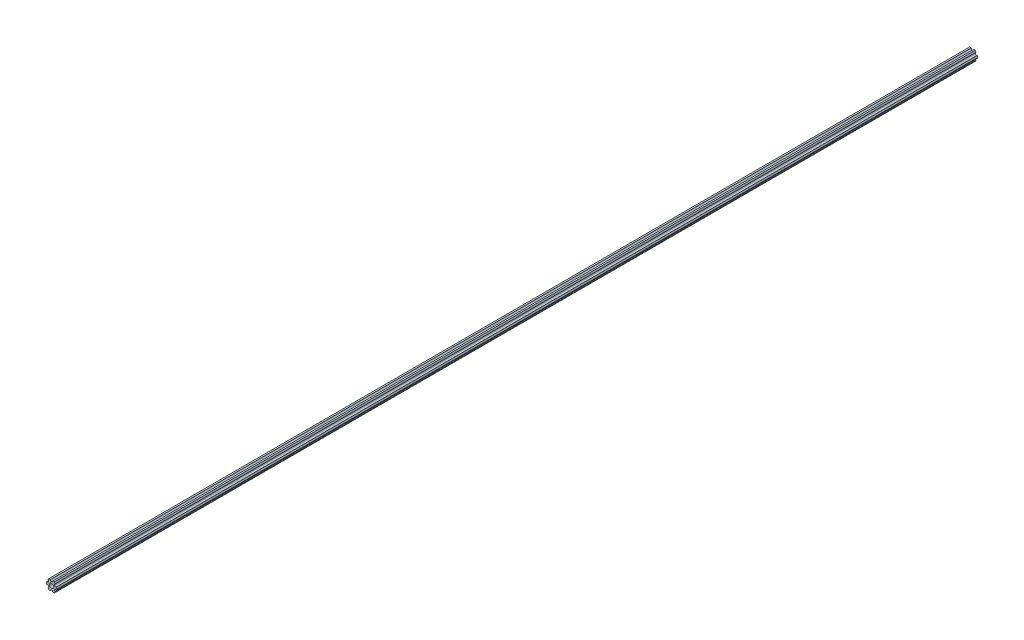
ISO-10303-21;
HEADER;
FILE_DESCRIPTION(('STEP AP214'),'2;1');
FILE_NAME('part.step','',(''),(''),'','','');
FILE_SCHEMA(('AUTOMOTIVE_DESIGN { 1 0 10303 214 1 1 1 1 }'));
ENDSEC;
DATA;
#1=APPLICATION_CONTEXT('core data for automotive mechanical design processes');
#2=APPLICATION_PROTOCOL_DEFINITION('international standard','automotive_design',2000,#1);
#3=PRODUCT_CONTEXT('',#1,'mechanical');
#4=PRODUCT('Part','Part','',(#3));
#5=PRODUCT_RELATED_PRODUCT_CATEGORY('part','',(#4));
#6=PRODUCT_DEFINITION_FORMATION('','',#4);
#7=PRODUCT_DEFINITION_CONTEXT('part definition',#1,'design');
#8=PRODUCT_DEFINITION('design','',#6,#7);
#9=PRODUCT_DEFINITION_SHAPE('','',#8);
#10=(LENGTH_UNIT() NAMED_UNIT(*) SI_UNIT(.MILLI.,.METRE.));
#11=(NAMED_UNIT(*) PLANE_ANGLE_UNIT() SI_UNIT($,.RADIAN.));
#12=(NAMED_UNIT(*) SI_UNIT($,.STERADIAN.) SOLID_ANGLE_UNIT());
#13=UNCERTAINTY_MEASURE_WITH_UNIT(LENGTH_MEASURE(1.E-05),#10,'distance_accuracy_value','');
#14=(GEOMETRIC_REPRESENTATION_CONTEXT(3) GLOBAL_UNCERTAINTY_ASSIGNED_CONTEXT((#13)) GLOBAL_UNIT_ASSIGNED_CONTEXT((#10,
#11,#12)) REPRESENTATION_CONTEXT('',''));
#15=CARTESIAN_POINT('',(0.,0.,0.));
#16=DIRECTION('',(0.,0.,1.));
#17=DIRECTION('',(1.,0.,0.));
#18=AXIS2_PLACEMENT_3D('',#15,#16,#17);
#19=CARTESIAN_POINT('',(6.2949162936079,-1.79688515007796,1212.088));
#20=DIRECTION('',(-0.866025403784439,0.499999999999999,0.));
#21=DIRECTION('',(-0.499999999999999,-0.866025403784439,0.));
#22=AXIS2_PLACEMENT_3D('',#19,#20,#21);
#23=PLANE('',#22);
#24=DIRECTION('',(0.,0.,1.));
#25=VECTOR('',#24,1.);
#26=CARTESIAN_POINT('',(7.33234841870824,0.,1212.088));
#27=LINE('',#26,#25);
#28=CARTESIAN_POINT('',(7.33234841870824,0.,0.));
#29=VERTEX_POINT('',#28);
#30=CARTESIAN_POINT('',(7.33234841870824,0.,1212.088));
#31=VERTEX_POINT('',#30);
#32=EDGE_CURVE('E299',#29,#31,#27,.T.);
#33=ORIENTED_EDGE('',*,*,#32,.T.);
#34=DIRECTION('',(0.499999999999999,0.866025403784439,0.));
#35=VECTOR('',#34,1.);
#36=CARTESIAN_POINT('',(6.2949162936079,-1.79688515007796,1212.088));
#37=LINE('',#36,#35);
#38=CARTESIAN_POINT('',(6.2949162936079,-1.79688515007796,1212.088));
#39=VERTEX_POINT('',#38);
#40=EDGE_CURVE('E182',#39,#31,#37,.T.);
#41=ORIENTED_EDGE('',*,*,#40,.F.);
#42=DIRECTION('',(0.,0.,-1.));
#43=VECTOR('',#42,1.);
#44=CARTESIAN_POINT('',(6.2949162936079,-1.79688515007796,1212.088));
#45=LINE('',#44,#43);
#46=CARTESIAN_POINT('',(6.2949162936079,-1.79688515007796,0.));
#47=VERTEX_POINT('',#46);
#48=EDGE_CURVE('E248',#39,#47,#45,.T.);
#49=ORIENTED_EDGE('',*,*,#48,.T.);
#50=DIRECTION('',(0.499999999999999,0.866025403784439,0.));
#51=VECTOR('',#50,1.);
#52=CARTESIAN_POINT('',(6.2949162936079,-1.79688515007796,0.));
#53=LINE('',#52,#51);
#54=EDGE_CURVE('E186',#47,#29,#53,.T.);
#55=ORIENTED_EDGE('',*,*,#54,.T.);
#56=EDGE_LOOP('',(#33,#41,#49,#55));
#57=FACE_BOUND('',#56,.T.);
#58=ADVANCED_FACE('F17',(#57),#23,.F.);
#59=CARTESIAN_POINT('',(7.33234841870824,0.,1212.088));
#60=DIRECTION('',(-0.866025403784439,-0.5,0.));
#61=DIRECTION('',(0.5,-0.866025403784439,0.));
#62=AXIS2_PLACEMENT_3D('',#59,#60,#61);
#63=PLANE('',#62);
#64=DIRECTION('',(0.,0.,-1.));
#65=VECTOR('',#64,1.);
#66=CARTESIAN_POINT('',(6.2949162936079,1.79688515007796,1212.088));
#67=LINE('',#66,#65);
#68=CARTESIAN_POINT('',(6.2949162936079,1.79688515007796,0.));
#69=VERTEX_POINT('',#68);
#70=CARTESIAN_POINT('',(6.2949162936079,1.79688515007796,1212.088));
#71=VERTEX_POINT('',#70);
#72=EDGE_CURVE('E297',#69,#71,#67,.F.);
#73=ORIENTED_EDGE('',*,*,#72,.T.);
#74=DIRECTION('',(-0.499999999999999,0.866025403784439,0.));
#75=VECTOR('',#74,1.);
#76=CARTESIAN_POINT('',(7.33234841870824,0.,1212.088));
#77=LINE('',#76,#75);
#78=EDGE_CURVE('E64',#31,#71,#77,.T.);
#79=ORIENTED_EDGE('',*,*,#78,.F.);
#80=ORIENTED_EDGE('',*,*,#32,.F.);
#81=DIRECTION('',(-0.499999999999999,0.866025403784439,0.));
#82=VECTOR('',#81,1.);
#83=CARTESIAN_POINT('',(7.33234841870824,0.,0.));
#84=LINE('',#83,#82);
#85=EDGE_CURVE('E245',#29,#69,#84,.T.);
#86=ORIENTED_EDGE('',*,*,#85,.T.);
#87=EDGE_LOOP('',(#73,#79,#80,#86));
#88=FACE_BOUND('',#87,.T.);
#89=ADVANCED_FACE('F346',(#88),#63,.F.);
#90=CARTESIAN_POINT('',(5.49926131403119,3.175,1212.088));
#91=DIRECTION('',(0.,0.,-1.));
#92=DIRECTION('',(-1.,0.,0.));
#93=AXIS2_PLACEMENT_3D('',#90,#91,#92);
#94=CYLINDRICAL_SURFACE('',#93,1.59130995915342);
#95=CARTESIAN_POINT('',(5.49926131403119,3.175,1212.088));
#96=DIRECTION('',(0.,0.,-1.));
#97=DIRECTION('',(-1.,0.,0.));
#98=AXIS2_PLACEMENT_3D('',#95,#96,#97);
#99=CIRCLE('',#98,1.59130995915342);
#100=CARTESIAN_POINT('',(4.70360633445448,4.55311484992204,1212.088));
#101=VERTEX_POINT('',#100);
#102=EDGE_CURVE('E56',#71,#101,#99,.T.);
#103=ORIENTED_EDGE('',*,*,#102,.F.);
#104=ORIENTED_EDGE('',*,*,#72,.F.);
#105=CARTESIAN_POINT('',(5.49926131403119,3.175,0.));
#106=DIRECTION('',(0.,0.,-1.));
#107=DIRECTION('',(-1.,0.,0.));
#108=AXIS2_PLACEMENT_3D('',#105,#106,#107);
#109=CIRCLE('',#108,1.59130995915342);
#110=CARTESIAN_POINT('',(4.70360633445448,4.55311484992204,0.));
#111=VERTEX_POINT('',#110);
#112=EDGE_CURVE('E20',#69,#111,#109,.T.);
#113=ORIENTED_EDGE('',*,*,#112,.T.);
#114=DIRECTION('',(0.,0.,1.));
#115=VECTOR('',#114,1.);
#116=CARTESIAN_POINT('',(4.70360633445448,4.55311484992204,1212.088));
#117=LINE('',#116,#115);
#118=EDGE_CURVE('E293',#111,#101,#117,.T.);
#119=ORIENTED_EDGE('',*,*,#118,.T.);
#120=EDGE_LOOP('',(#103,#104,#113,#119));
#121=FACE_BOUND('',#120,.T.);
#122=ADVANCED_FACE('F344',(#121),#94,.F.);
#123=CARTESIAN_POINT('',(4.70360633445448,4.55311484992204,1212.088));
#124=DIRECTION('',(-0.866025403784438,-0.500000000000001,0.));
#125=DIRECTION('',(0.500000000000001,-0.866025403784438,0.));
#126=AXIS2_PLACEMENT_3D('',#123,#124,#125);
#127=PLANE('',#126);
#128=DIRECTION('',(0.,0.,1.));
#129=VECTOR('',#128,1.);
#130=CARTESIAN_POINT('',(3.66617420935412,6.35,1212.088));
#131=LINE('',#130,#129);
#132=CARTESIAN_POINT('',(3.66617420935412,6.35,0.));
#133=VERTEX_POINT('',#132);
#134=CARTESIAN_POINT('',(3.66617420935412,6.35,1212.088));
#135=VERTEX_POINT('',#134);
#136=EDGE_CURVE('E290',#133,#135,#131,.T.);
#137=ORIENTED_EDGE('',*,*,#136,.T.);
#138=DIRECTION('',(-0.5,0.866025403784438,0.));
#139=VECTOR('',#138,1.);
#140=CARTESIAN_POINT('',(4.70360633445448,4.55311484992204,1212.088));
#141=LINE('',#140,#139);
#142=EDGE_CURVE('E175',#101,#135,#141,.T.);
#143=ORIENTED_EDGE('',*,*,#142,.F.);
#144=ORIENTED_EDGE('',*,*,#118,.F.);
#145=DIRECTION('',(-0.5,0.866025403784438,0.));
#146=VECTOR('',#145,1.);
#147=CARTESIAN_POINT('',(4.70360633445448,4.55311484992204,0.));
#148=LINE('',#147,#146);
#149=EDGE_CURVE('E238',#111,#133,#148,.T.);
#150=ORIENTED_EDGE('',*,*,#149,.T.);
#151=EDGE_LOOP('',(#137,#143,#144,#150));
#152=FACE_BOUND('',#151,.T.);
#153=ADVANCED_FACE('F337',(#152),#127,.F.);
#154=CARTESIAN_POINT('',(3.66617420935412,6.35,1212.088));
#155=DIRECTION('',(0.,-1.,0.));
#156=DIRECTION('',(1.,0.,0.));
#157=AXIS2_PLACEMENT_3D('',#154,#155,#156);
#158=PLANE('',#157);
#159=DIRECTION('',(0.,0.,-1.));
#160=VECTOR('',#159,1.);
#161=CARTESIAN_POINT('',(1.59130995915343,6.35,1212.088));
#162=LINE('',#161,#160);
#163=CARTESIAN_POINT('',(1.59130995915343,6.35,0.));
#164=VERTEX_POINT('',#163);
#165=CARTESIAN_POINT('',(1.59130995915343,6.35,1212.088));
#166=VERTEX_POINT('',#165);
#167=EDGE_CURVE('E288',#164,#166,#162,.F.);
#168=ORIENTED_EDGE('',*,*,#167,.T.);
#169=DIRECTION('',(1.,0.,0.));
#170=VECTOR('',#169,1.);
#171=CARTESIAN_POINT('',(5.49926131403119,6.35,1212.088));
#172=LINE('',#171,#170);
#173=EDGE_CURVE('E145',#135,#166,#172,.F.);
#174=ORIENTED_EDGE('',*,*,#173,.F.);
#175=ORIENTED_EDGE('',*,*,#136,.F.);
#176=DIRECTION('',(1.,0.,0.));
#177=VECTOR('',#176,1.);
#178=CARTESIAN_POINT('',(5.49926131403119,6.35,0.));
#179=LINE('',#178,#177);
#180=EDGE_CURVE('E235',#133,#164,#179,.F.);
#181=ORIENTED_EDGE('',*,*,#180,.T.);
#182=EDGE_LOOP('',(#168,#174,#175,#181));
#183=FACE_BOUND('',#182,.T.);
#184=ADVANCED_FACE('F334',(#183),#158,.F.);
#185=CARTESIAN_POINT('',(0.,6.35,1212.088));
#186=DIRECTION('',(0.,0.,-1.));
#187=DIRECTION('',(-1.,0.,0.));
#188=AXIS2_PLACEMENT_3D('',#185,#186,#187);
#189=CYLINDRICAL_SURFACE('',#188,1.59130995915342);
#190=DIRECTION('',(0.,0.,1.));
#191=VECTOR('',#190,1.);
#192=CARTESIAN_POINT('',(-1.59130995915342,6.35,1212.088));
#193=LINE('',#192,#191);
#194=CARTESIAN_POINT('',(-1.59130995915342,6.35,0.));
#195=VERTEX_POINT('',#194);
#196=CARTESIAN_POINT('',(-1.59130995915342,6.35,1212.088));
#197=VERTEX_POINT('',#196);
#198=EDGE_CURVE('E104',#195,#197,#193,.T.);
#199=ORIENTED_EDGE('',*,*,#198,.T.);
#200=CARTESIAN_POINT('',(0.,6.35,1212.088));
#201=DIRECTION('',(0.,0.,-1.));
#202=DIRECTION('',(-1.,0.,0.));
#203=AXIS2_PLACEMENT_3D('',#200,#201,#202);
#204=CIRCLE('',#203,1.59130995915342);
#205=EDGE_CURVE('E149',#166,#197,#204,.T.);
#206=ORIENTED_EDGE('',*,*,#205,.F.);
#207=ORIENTED_EDGE('',*,*,#167,.F.);
#208=CARTESIAN_POINT('',(0.,6.35,0.));
#209=DIRECTION('',(0.,0.,-1.));
#210=DIRECTION('',(-1.,0.,0.));
#211=AXIS2_PLACEMENT_3D('',#208,#209,#210);
#212=CIRCLE('',#211,1.59130995915342);
#213=EDGE_CURVE('E232',#164,#195,#212,.T.);
#214=ORIENTED_EDGE('',*,*,#213,.T.);
#215=EDGE_LOOP('',(#199,#206,#207,#214));
#216=FACE_BOUND('',#215,.T.);
#217=ADVANCED_FACE('F328',(#216),#189,.F.);
#218=CARTESIAN_POINT('',(-1.59130995915342,6.35,1212.088));
#219=DIRECTION('',(0.,-1.,0.));
#220=DIRECTION('',(1.,0.,0.));
#221=AXIS2_PLACEMENT_3D('',#218,#219,#220);
#222=PLANE('',#221);
#223=DIRECTION('',(0.,0.,1.));
#224=VECTOR('',#223,1.);
#225=CARTESIAN_POINT('',(-3.66617420935412,6.35,1212.088));
#226=LINE('',#225,#224);
#227=CARTESIAN_POINT('',(-3.66617420935412,6.35,0.));
#228=VERTEX_POINT('',#227);
#229=CARTESIAN_POINT('',(-3.66617420935412,6.35,1212.088));
#230=VERTEX_POINT('',#229);
#231=EDGE_CURVE('E112',#228,#230,#226,.T.);
#232=ORIENTED_EDGE('',*,*,#231,.T.);
#233=DIRECTION('',(1.,0.,0.));
#234=VECTOR('',#233,1.);
#235=CARTESIAN_POINT('',(5.49926131403119,6.35,1212.088));
#236=LINE('',#235,#234);
#237=EDGE_CURVE('E150',#197,#230,#236,.F.);
#238=ORIENTED_EDGE('',*,*,#237,.F.);
#239=ORIENTED_EDGE('',*,*,#198,.F.);
#240=DIRECTION('',(1.,0.,0.));
#241=VECTOR('',#240,1.);
#242=CARTESIAN_POINT('',(5.49926131403119,6.35,0.));
#243=LINE('',#242,#241);
#244=EDGE_CURVE('E157',#195,#228,#243,.F.);
#245=ORIENTED_EDGE('',*,*,#244,.T.);
#246=EDGE_LOOP('',(#232,#238,#239,#245));
#247=FACE_BOUND('',#246,.T.);
#248=ADVANCED_FACE('F156',(#247),#222,.F.);
#249=CARTESIAN_POINT('',(-3.66617420935412,6.35,1212.088));
#250=DIRECTION('',(0.866025403784439,-0.5,0.));
#251=DIRECTION('',(0.5,0.866025403784439,0.));
#252=AXIS2_PLACEMENT_3D('',#249,#250,#251);
#253=PLANE('',#252);
#254=DIRECTION('',(0.,0.,-1.));
#255=VECTOR('',#254,1.);
#256=CARTESIAN_POINT('',(-4.70360633445447,4.55311484992205,1212.088));
#257=LINE('',#256,#255);
#258=CARTESIAN_POINT('',(-4.70360633445447,4.55311484992205,0.));
#259=VERTEX_POINT('',#258);
#260=CARTESIAN_POINT('',(-4.70360633445447,4.55311484992205,1212.088));
#261=VERTEX_POINT('',#260);
#262=EDGE_CURVE('E158',#259,#261,#257,.F.);
#263=ORIENTED_EDGE('',*,*,#262,.T.);
#264=DIRECTION('',(-0.5,-0.866025403784439,0.));
#265=VECTOR('',#264,1.);
#266=CARTESIAN_POINT('',(-3.66617420935412,6.35,1212.088));
#267=LINE('',#266,#265);
#268=EDGE_CURVE('E153',#230,#261,#267,.T.);
#269=ORIENTED_EDGE('',*,*,#268,.F.);
#270=ORIENTED_EDGE('',*,*,#231,.F.);
#271=DIRECTION('',(-0.5,-0.866025403784439,0.));
#272=VECTOR('',#271,1.);
#273=CARTESIAN_POINT('',(-3.66617420935412,6.35,0.));
#274=LINE('',#273,#272);
#275=EDGE_CURVE('E227',#228,#259,#274,.T.);
#276=ORIENTED_EDGE('',*,*,#275,.T.);
#277=EDGE_LOOP('',(#263,#269,#270,#276));
#278=FACE_BOUND('',#277,.T.);
#279=ADVANCED_FACE('F160',(#278),#253,.F.);
#280=CARTESIAN_POINT('',(-5.49926131403118,3.175,1212.088));
#281=DIRECTION('',(0.,0.,-1.));
#282=DIRECTION('',(-1.,0.,0.));
#283=AXIS2_PLACEMENT_3D('',#280,#281,#282);
#284=CYLINDRICAL_SURFACE('',#283,1.59130995915342);
#285=DIRECTION('',(0.,0.,1.));
#286=VECTOR('',#285,1.);
#287=CARTESIAN_POINT('',(-6.2949162936079,1.79688515007796,1212.088));
#288=LINE('',#287,#286);
#289=CARTESIAN_POINT('',(-6.29491629360789,1.79688515007796,0.));
#290=VERTEX_POINT('',#289);
#291=CARTESIAN_POINT('',(-6.29491629360789,1.79688515007796,1212.088));
#292=VERTEX_POINT('',#291);
#293=EDGE_CURVE('E279',#290,#292,#288,.T.);
#294=ORIENTED_EDGE('',*,*,#293,.T.);
#295=CARTESIAN_POINT('',(-5.49926131403118,3.175,1212.088));
#296=DIRECTION('',(0.,0.,-1.));
#297=DIRECTION('',(-1.,0.,0.));
#298=AXIS2_PLACEMENT_3D('',#295,#296,#297);
#299=CIRCLE('',#298,1.59130995915342);
#300=EDGE_CURVE('E162',#261,#292,#299,.T.);
#301=ORIENTED_EDGE('',*,*,#300,.F.);
#302=ORIENTED_EDGE('',*,*,#262,.F.);
#303=CARTESIAN_POINT('',(-5.49926131403118,3.175,0.));
#304=DIRECTION('',(0.,0.,-1.));
#305=DIRECTION('',(-1.,0.,0.));
#306=AXIS2_PLACEMENT_3D('',#303,#304,#305);
#307=CIRCLE('',#306,1.59130995915342);
#308=EDGE_CURVE('E224',#259,#290,#307,.T.);
#309=ORIENTED_EDGE('',*,*,#308,.T.);
#310=EDGE_LOOP('',(#294,#301,#302,#309));
#311=FACE_BOUND('',#310,.T.);
#312=ADVANCED_FACE('F409',(#311),#284,.F.);
#313=CARTESIAN_POINT('',(-6.2949162936079,1.79688515007796,1212.088));
#314=DIRECTION('',(0.866025403784439,-0.5,0.));
#315=DIRECTION('',(0.5,0.866025403784439,0.));
#316=AXIS2_PLACEMENT_3D('',#313,#314,#315);
#317=PLANE('',#316);
#318=DIRECTION('',(0.,0.,1.));
#319=VECTOR('',#318,1.);
#320=CARTESIAN_POINT('',(-7.33234841870825,0.,1212.088));
#321=LINE('',#320,#319);
#322=CARTESIAN_POINT('',(-7.33234841870825,0.,0.));
#323=VERTEX_POINT('',#322);
#324=CARTESIAN_POINT('',(-7.33234841870825,0.,1212.088));
#325=VERTEX_POINT('',#324);
#326=EDGE_CURVE('E276',#323,#325,#321,.T.);
#327=ORIENTED_EDGE('',*,*,#326,.T.);
#328=DIRECTION('',(-0.5,-0.866025403784438,0.));
#329=VECTOR('',#328,1.);
#330=CARTESIAN_POINT('',(-6.29491629360789,1.79688515007796,1212.088));
#331=LINE('',#330,#329);
#332=EDGE_CURVE('E164',#292,#325,#331,.T.);
#333=ORIENTED_EDGE('',*,*,#332,.F.);
#334=ORIENTED_EDGE('',*,*,#293,.F.);
#335=DIRECTION('',(-0.5,-0.866025403784438,0.));
#336=VECTOR('',#335,1.);
#337=CARTESIAN_POINT('',(-6.29491629360789,1.79688515007796,0.));
#338=LINE('',#337,#336);
#339=EDGE_CURVE('E219',#290,#323,#338,.T.);
#340=ORIENTED_EDGE('',*,*,#339,.T.);
#341=EDGE_LOOP('',(#327,#333,#334,#340));
#342=FACE_BOUND('',#341,.T.);
#343=ADVANCED_FACE('F377',(#342),#317,.F.);
#344=CARTESIAN_POINT('',(-7.33234841870825,0.,1212.088));
#345=DIRECTION('',(0.866025403784439,0.499999999999999,0.));
#346=DIRECTION('',(-0.499999999999999,0.866025403784439,0.));
#347=AXIS2_PLACEMENT_3D('',#344,#345,#346);
#348=PLANE('',#347);
#349=DIRECTION('',(0.,0.,-1.));
#350=VECTOR('',#349,1.);
#351=CARTESIAN_POINT('',(-6.2949162936079,-1.79688515007796,1212.088));
#352=LINE('',#351,#350);
#353=CARTESIAN_POINT('',(-6.2949162936079,-1.79688515007796,0.));
#354=VERTEX_POINT('',#353);
#355=CARTESIAN_POINT('',(-6.2949162936079,-1.79688515007796,1212.088));
#356=VERTEX_POINT('',#355);
#357=EDGE_CURVE('E273',#354,#356,#352,.F.);
#358=ORIENTED_EDGE('',*,*,#357,.T.);
#359=DIRECTION('',(0.5,-0.866025403784439,0.));
#360=VECTOR('',#359,1.);
#361=CARTESIAN_POINT('',(-7.33234841870825,0.,1212.088));
#362=LINE('',#361,#360);
#363=EDGE_CURVE('E314',#325,#356,#362,.T.);
#364=ORIENTED_EDGE('',*,*,#363,.F.);
#365=ORIENTED_EDGE('',*,*,#326,.F.);
#366=DIRECTION('',(0.5,-0.866025403784439,0.));
#367=VECTOR('',#366,1.);
#368=CARTESIAN_POINT('',(-7.33234841870825,0.,0.));
#369=LINE('',#368,#367);
#370=EDGE_CURVE('E216',#323,#354,#369,.T.);
#371=ORIENTED_EDGE('',*,*,#370,.T.);
#372=EDGE_LOOP('',(#358,#364,#365,#371));
#373=FACE_BOUND('',#372,.T.);
#374=ADVANCED_FACE('F381',(#373),#348,.F.);
#375=CARTESIAN_POINT('',(-5.49926131403119,-3.175,1212.088));
#376=DIRECTION('',(0.,0.,-1.));
#377=DIRECTION('',(-1.,0.,0.));
#378=AXIS2_PLACEMENT_3D('',#375,#376,#377);
#379=CYLINDRICAL_SURFACE('',#378,1.59130995915342);
#380=DIRECTION('',(0.,0.,1.));
#381=VECTOR('',#380,1.);
#382=CARTESIAN_POINT('',(-4.70360633445447,-4.55311484992204,1212.088));
#383=LINE('',#382,#381);
#384=CARTESIAN_POINT('',(-4.70360633445447,-4.55311484992204,0.));
#385=VERTEX_POINT('',#384);
#386=CARTESIAN_POINT('',(-4.70360633445447,-4.55311484992204,1212.088));
#387=VERTEX_POINT('',#386);
#388=EDGE_CURVE('E268',#385,#387,#383,.T.);
#389=ORIENTED_EDGE('',*,*,#388,.T.);
#390=CARTESIAN_POINT('',(-5.49926131403119,-3.175,1212.088));
#391=DIRECTION('',(0.,0.,-1.));
#392=DIRECTION('',(-1.,0.,0.));
#393=AXIS2_PLACEMENT_3D('',#390,#391,#392);
#394=CIRCLE('',#393,1.59130995915342);
#395=EDGE_CURVE('E312',#356,#387,#394,.T.);
#396=ORIENTED_EDGE('',*,*,#395,.F.);
#397=ORIENTED_EDGE('',*,*,#357,.F.);
#398=CARTESIAN_POINT('',(-5.49926131403119,-3.175,0.));
#399=DIRECTION('',(0.,0.,-1.));
#400=DIRECTION('',(-1.,0.,0.));
#401=AXIS2_PLACEMENT_3D('',#398,#399,#400);
#402=CIRCLE('',#401,1.59130995915342);
#403=EDGE_CURVE('E213',#354,#385,#402,.T.);
#404=ORIENTED_EDGE('',*,*,#403,.T.);
#405=EDGE_LOOP('',(#389,#396,#397,#404));
#406=FACE_BOUND('',#405,.T.);
#407=ADVANCED_FACE('F385',(#406),#379,.F.);
#408=CARTESIAN_POINT('',(-4.70360633445447,-4.55311484992204,1212.088));
#409=DIRECTION('',(0.866025403784439,0.5,0.));
#410=DIRECTION('',(-0.5,0.866025403784439,0.));
#411=AXIS2_PLACEMENT_3D('',#408,#409,#410);
#412=PLANE('',#411);
#413=DIRECTION('',(0.,0.,1.));
#414=VECTOR('',#413,1.);
#415=CARTESIAN_POINT('',(-3.66617420935412,-6.35,1212.088));
#416=LINE('',#415,#414);
#417=CARTESIAN_POINT('',(-3.66617420935412,-6.35,0.));
#418=VERTEX_POINT('',#417);
#419=CARTESIAN_POINT('',(-3.66617420935412,-6.35,1212.088));
#420=VERTEX_POINT('',#419);
#421=EDGE_CURVE('E265',#418,#420,#416,.T.);
#422=ORIENTED_EDGE('',*,*,#421,.T.);
#423=DIRECTION('',(0.5,-0.866025403784438,0.));
#424=VECTOR('',#423,1.);
#425=CARTESIAN_POINT('',(-4.70360633445448,-4.55311484992204,1212.088));
#426=LINE('',#425,#424);
#427=EDGE_CURVE('E313',#387,#420,#426,.T.);
#428=ORIENTED_EDGE('',*,*,#427,.F.);
#429=ORIENTED_EDGE('',*,*,#388,.F.);
#430=DIRECTION('',(0.5,-0.866025403784438,0.));
#431=VECTOR('',#430,1.);
#432=CARTESIAN_POINT('',(-4.70360633445448,-4.55311484992204,0.));
#433=LINE('',#432,#431);
#434=EDGE_CURVE('E208',#385,#418,#433,.T.);
#435=ORIENTED_EDGE('',*,*,#434,.T.);
#436=EDGE_LOOP('',(#422,#428,#429,#435));
#437=FACE_BOUND('',#436,.T.);
#438=ADVANCED_FACE('F391',(#437),#412,.F.);
#439=CARTESIAN_POINT('',(-3.66617420935412,-6.35,1212.088));
#440=DIRECTION('',(0.,1.,0.));
#441=DIRECTION('',(-1.,0.,0.));
#442=AXIS2_PLACEMENT_3D('',#439,#440,#441);
#443=PLANE('',#442);
#444=DIRECTION('',(0.,0.,-1.));
#445=VECTOR('',#444,1.);
#446=CARTESIAN_POINT('',(-1.59130995915342,-6.35,1212.088));
#447=LINE('',#446,#445);
#448=CARTESIAN_POINT('',(-1.59130995915342,-6.35,0.));
#449=VERTEX_POINT('',#448);
#450=CARTESIAN_POINT('',(-1.59130995915342,-6.35,1212.088));
#451=VERTEX_POINT('',#450);
#452=EDGE_CURVE('E262',#449,#451,#447,.F.);
#453=ORIENTED_EDGE('',*,*,#452,.T.);
#454=DIRECTION('',(1.,0.,0.));
#455=VECTOR('',#454,1.);
#456=CARTESIAN_POINT('',(5.49926131403119,-6.35,1212.088));
#457=LINE('',#456,#455);
#458=EDGE_CURVE('E311',#420,#451,#457,.T.);
#459=ORIENTED_EDGE('',*,*,#458,.F.);
#460=ORIENTED_EDGE('',*,*,#421,.F.);
#461=DIRECTION('',(1.,0.,0.));
#462=VECTOR('',#461,1.);
#463=CARTESIAN_POINT('',(5.49926131403119,-6.35,0.));
#464=LINE('',#463,#462);
#465=EDGE_CURVE('E205',#418,#449,#464,.T.);
#466=ORIENTED_EDGE('',*,*,#465,.T.);
#467=EDGE_LOOP('',(#453,#459,#460,#466));
#468=FACE_BOUND('',#467,.T.);
#469=ADVANCED_FACE('F395',(#468),#443,.F.);
#470=CARTESIAN_POINT('',(0.,-6.35,1212.088));
#471=DIRECTION('',(0.,0.,-1.));
#472=DIRECTION('',(-1.,0.,0.));
#473=AXIS2_PLACEMENT_3D('',#470,#471,#472);
#474=CYLINDRICAL_SURFACE('',#473,1.59130995915342);
#475=DIRECTION('',(0.,0.,1.));
#476=VECTOR('',#475,1.);
#477=CARTESIAN_POINT('',(1.59130995915342,-6.35,1212.088));
#478=LINE('',#477,#476);
#479=CARTESIAN_POINT('',(1.59130995915342,-6.35,0.));
#480=VERTEX_POINT('',#479);
#481=CARTESIAN_POINT('',(1.59130995915342,-6.35,1212.088));
#482=VERTEX_POINT('',#481);
#483=EDGE_CURVE('E257',#480,#482,#478,.T.);
#484=ORIENTED_EDGE('',*,*,#483,.T.);
#485=CARTESIAN_POINT('',(0.,-6.35,1212.088));
#486=DIRECTION('',(0.,0.,-1.));
#487=DIRECTION('',(-1.,0.,0.));
#488=AXIS2_PLACEMENT_3D('',#485,#486,#487);
#489=CIRCLE('',#488,1.59130995915342);
#490=EDGE_CURVE('E308',#451,#482,#489,.T.);
#491=ORIENTED_EDGE('',*,*,#490,.F.);
#492=ORIENTED_EDGE('',*,*,#452,.F.);
#493=CARTESIAN_POINT('',(0.,-6.35,0.));
#494=DIRECTION('',(0.,0.,-1.));
#495=DIRECTION('',(-1.,0.,0.));
#496=AXIS2_PLACEMENT_3D('',#493,#494,#495);
#497=CIRCLE('',#496,1.59130995915342);
#498=EDGE_CURVE('E202',#449,#480,#497,.T.);
#499=ORIENTED_EDGE('',*,*,#498,.T.);
#500=EDGE_LOOP('',(#484,#491,#492,#499));
#501=FACE_BOUND('',#500,.T.);
#502=ADVANCED_FACE('F399',(#501),#474,.F.);
#503=CARTESIAN_POINT('',(1.59130995915342,-6.35,1212.088));
#504=DIRECTION('',(0.,1.,0.));
#505=DIRECTION('',(0.,0.,1.));
#506=AXIS2_PLACEMENT_3D('',#503,#504,#505);
#507=PLANE('',#506);
#508=DIRECTION('',(0.,0.,1.));
#509=VECTOR('',#508,1.);
#510=CARTESIAN_POINT('',(3.66617420935413,-6.35,1212.088));
#511=LINE('',#510,#509);
#512=CARTESIAN_POINT('',(3.66617420935413,-6.35,-2.22044604925031E-13));
#513=VERTEX_POINT('',#512);
#514=CARTESIAN_POINT('',(3.66617420935413,-6.35,1212.088));
#515=VERTEX_POINT('',#514);
#516=EDGE_CURVE('E254',#513,#515,#511,.T.);
#517=ORIENTED_EDGE('',*,*,#516,.T.);
#518=DIRECTION('',(1.,0.,0.));
#519=VECTOR('',#518,1.);
#520=CARTESIAN_POINT('',(5.49926131403119,-6.35,1212.088));
#521=LINE('',#520,#519);
#522=EDGE_CURVE('E310',#482,#515,#521,.T.);
#523=ORIENTED_EDGE('',*,*,#522,.F.);
#524=ORIENTED_EDGE('',*,*,#483,.F.);
#525=DIRECTION('',(1.,0.,0.));
#526=VECTOR('',#525,1.);
#527=CARTESIAN_POINT('',(5.49926131403119,-6.35,0.));
#528=LINE('',#527,#526);
#529=EDGE_CURVE('E197',#480,#513,#528,.T.);
#530=ORIENTED_EDGE('',*,*,#529,.T.);
#531=EDGE_LOOP('',(#517,#523,#524,#530));
#532=FACE_BOUND('',#531,.T.);
#533=ADVANCED_FACE('F402',(#532),#507,.F.);
#534=CARTESIAN_POINT('',(3.66617420935413,-6.35,1212.088));
#535=DIRECTION('',(-0.866025403784438,0.500000000000001,0.));
#536=DIRECTION('',(-0.500000000000001,-0.866025403784438,0.));
#537=AXIS2_PLACEMENT_3D('',#534,#535,#536);
#538=PLANE('',#537);
#539=DIRECTION('',(0.,0.,1.));
#540=VECTOR('',#539,1.);
#541=CARTESIAN_POINT('',(4.70360633445448,-4.55311484992204,1212.088));
#542=LINE('',#541,#540);
#543=CARTESIAN_POINT('',(4.70360633445448,-4.55311484992204,1212.088));
#544=VERTEX_POINT('',#543);
#545=CARTESIAN_POINT('',(4.70360633445448,-4.55311484992204,0.));
#546=VERTEX_POINT('',#545);
#547=EDGE_CURVE('E252',#544,#546,#542,.F.);
#548=ORIENTED_EDGE('',*,*,#547,.F.);
#549=DIRECTION('',(0.5,0.866025403784438,0.));
#550=VECTOR('',#549,1.);
#551=CARTESIAN_POINT('',(3.66617420935413,-6.35,1212.088));
#552=LINE('',#551,#550);
#553=EDGE_CURVE('E307',#515,#544,#552,.T.);
#554=ORIENTED_EDGE('',*,*,#553,.F.);
#555=ORIENTED_EDGE('',*,*,#516,.F.);
#556=DIRECTION('',(0.5,0.866025403784438,0.));
#557=VECTOR('',#556,1.);
#558=CARTESIAN_POINT('',(3.66617420935413,-6.35,0.));
#559=LINE('',#558,#557);
#560=EDGE_CURVE('E194',#513,#546,#559,.T.);
#561=ORIENTED_EDGE('',*,*,#560,.T.);
#562=EDGE_LOOP('',(#548,#554,#555,#561));
#563=FACE_BOUND('',#562,.T.);
#564=ADVANCED_FACE('F404',(#563),#538,.F.);
#565=CARTESIAN_POINT('',(5.49926131403118,-3.175,1212.088));
#566=DIRECTION('',(0.,0.,-1.));
#567=DIRECTION('',(-1.,0.,0.));
#568=AXIS2_PLACEMENT_3D('',#565,#566,#567);
#569=CYLINDRICAL_SURFACE('',#568,1.59130995915342);
#570=CARTESIAN_POINT('',(5.49926131403118,-3.175,1212.088));
#571=DIRECTION('',(0.,0.,-1.));
#572=DIRECTION('',(-1.,0.,0.));
#573=AXIS2_PLACEMENT_3D('',#570,#571,#572);
#574=CIRCLE('',#573,1.59130995915342);
#575=EDGE_CURVE('E35',#544,#39,#574,.T.);
#576=ORIENTED_EDGE('',*,*,#575,.F.);
#577=ORIENTED_EDGE('',*,*,#547,.T.);
#578=CARTESIAN_POINT('',(5.49926131403118,-3.175,0.));
#579=DIRECTION('',(0.,0.,-1.));
#580=DIRECTION('',(-1.,0.,0.));
#581=AXIS2_PLACEMENT_3D('',#578,#579,#580);
#582=CIRCLE('',#581,1.59130995915342);
#583=EDGE_CURVE('E191',#546,#47,#582,.T.);
#584=ORIENTED_EDGE('',*,*,#583,.T.);
#585=ORIENTED_EDGE('',*,*,#48,.F.);
#586=EDGE_LOOP('',(#576,#577,#584,#585));
#587=FACE_BOUND('',#586,.T.);
#588=ADVANCED_FACE('F350',(#587),#569,.F.);
#589=CARTESIAN_POINT('',(5.49926131403119,3.175,0.));
#590=DIRECTION('',(0.,0.,1.));
#591=DIRECTION('',(1.,0.,0.));
#592=AXIS2_PLACEMENT_3D('',#589,#590,#591);
#593=PLANE('',#592);
#594=CARTESIAN_POINT('',(0.,0.,0.));
#595=DIRECTION('',(0.,0.,-1.));
#596=DIRECTION('',(-1.,0.,0.));
#597=AXIS2_PLACEMENT_3D('',#594,#595,#596);
#598=CIRCLE('',#597,2.9337);
#599=CARTESIAN_POINT('',(-2.9337,0.,0.));
#600=VERTEX_POINT('',#599);
#601=EDGE_CURVE('E26',#600,#600,#598,.F.);
#602=ORIENTED_EDGE('',*,*,#601,.T.);
#603=EDGE_LOOP('',(#602));
#604=FACE_BOUND('',#603,.T.);
#605=ORIENTED_EDGE('',*,*,#583,.F.);
#606=ORIENTED_EDGE('',*,*,#560,.F.);
#607=ORIENTED_EDGE('',*,*,#529,.F.);
#608=ORIENTED_EDGE('',*,*,#498,.F.);
#609=ORIENTED_EDGE('',*,*,#465,.F.);
#610=ORIENTED_EDGE('',*,*,#434,.F.);
#611=ORIENTED_EDGE('',*,*,#403,.F.);
#612=ORIENTED_EDGE('',*,*,#370,.F.);
#613=ORIENTED_EDGE('',*,*,#339,.F.);
#614=ORIENTED_EDGE('',*,*,#308,.F.);
#615=ORIENTED_EDGE('',*,*,#275,.F.);
#616=ORIENTED_EDGE('',*,*,#244,.F.);
#617=ORIENTED_EDGE('',*,*,#213,.F.);
#618=ORIENTED_EDGE('',*,*,#180,.F.);
#619=ORIENTED_EDGE('',*,*,#149,.F.);
#620=ORIENTED_EDGE('',*,*,#112,.F.);
#621=ORIENTED_EDGE('',*,*,#85,.F.);
#622=ORIENTED_EDGE('',*,*,#54,.F.);
#623=EDGE_LOOP('',(#605,#606,#607,#608,#609,#610,#611,#612,#613,#614,#615,#616,#617,#618,#619,
#620,#621,#622));
#624=FACE_BOUND('',#623,.T.);
#625=ADVANCED_FACE('F331',(#604,#624),#593,.F.);
#626=CARTESIAN_POINT('',(5.49926131403119,3.175,1212.088));
#627=DIRECTION('',(0.,0.,1.));
#628=DIRECTION('',(1.,0.,0.));
#629=AXIS2_PLACEMENT_3D('',#626,#627,#628);
#630=PLANE('',#629);
#631=CARTESIAN_POINT('',(0.,0.,1212.088));
#632=DIRECTION('',(0.,0.,-1.));
#633=DIRECTION('',(-1.,0.,0.));
#634=AXIS2_PLACEMENT_3D('',#631,#632,#633);
#635=CIRCLE('',#634,2.9337);
#636=CARTESIAN_POINT('',(-2.9337,0.,1212.088));
#637=VERTEX_POINT('',#636);
#638=EDGE_CURVE('E11',#637,#637,#635,.T.);
#639=ORIENTED_EDGE('',*,*,#638,.T.);
#640=EDGE_LOOP('',(#639));
#641=FACE_BOUND('',#640,.T.);
#642=ORIENTED_EDGE('',*,*,#553,.T.);
#643=ORIENTED_EDGE('',*,*,#575,.T.);
#644=ORIENTED_EDGE('',*,*,#40,.T.);
#645=ORIENTED_EDGE('',*,*,#78,.T.);
#646=ORIENTED_EDGE('',*,*,#102,.T.);
#647=ORIENTED_EDGE('',*,*,#142,.T.);
#648=ORIENTED_EDGE('',*,*,#173,.T.);
#649=ORIENTED_EDGE('',*,*,#205,.T.);
#650=ORIENTED_EDGE('',*,*,#237,.T.);
#651=ORIENTED_EDGE('',*,*,#268,.T.);
#652=ORIENTED_EDGE('',*,*,#300,.T.);
#653=ORIENTED_EDGE('',*,*,#332,.T.);
#654=ORIENTED_EDGE('',*,*,#363,.T.);
#655=ORIENTED_EDGE('',*,*,#395,.T.);
#656=ORIENTED_EDGE('',*,*,#427,.T.);
#657=ORIENTED_EDGE('',*,*,#458,.T.);
#658=ORIENTED_EDGE('',*,*,#490,.T.);
#659=ORIENTED_EDGE('',*,*,#522,.T.);
#660=EDGE_LOOP('',(#642,#643,#644,#645,#646,#647,#648,#649,#650,#651,#652,#653,#654,#655,#656,
#657,#658,#659));
#661=FACE_BOUND('',#660,.T.);
#662=ADVANCED_FACE('F152',(#641,#661),#630,.T.);
#663=CARTESIAN_POINT('',(0.,0.,1212.088));
#664=DIRECTION('',(0.,0.,-1.));
#665=DIRECTION('',(-1.,0.,0.));
#666=AXIS2_PLACEMENT_3D('',#663,#664,#665);
#667=CYLINDRICAL_SURFACE('',#666,2.9337);
#668=ORIENTED_EDGE('',*,*,#601,.F.);
#669=EDGE_LOOP('',(#668));
#670=FACE_BOUND('',#669,.T.);
#671=ORIENTED_EDGE('',*,*,#638,.F.);
#672=EDGE_LOOP('',(#671));
#673=FACE_BOUND('',#672,.T.);
#674=ADVANCED_FACE('F419',(#670,#673),#667,.F.);
#675=CLOSED_SHELL('',(#58,#89,#122,#153,#184,#217,#248,#279,#312,#343,#374,#407,#438,#469,#502,
#533,#564,#588,#625,#662,#674));
#676=MANIFOLD_SOLID_BREP('B1',#675);
#677=ADVANCED_BREP_SHAPE_REPRESENTATION('',(#18,#676),#14);
#678=SHAPE_DEFINITION_REPRESENTATION(#9,#677);
ENDSEC;
END-ISO-10303-21;
